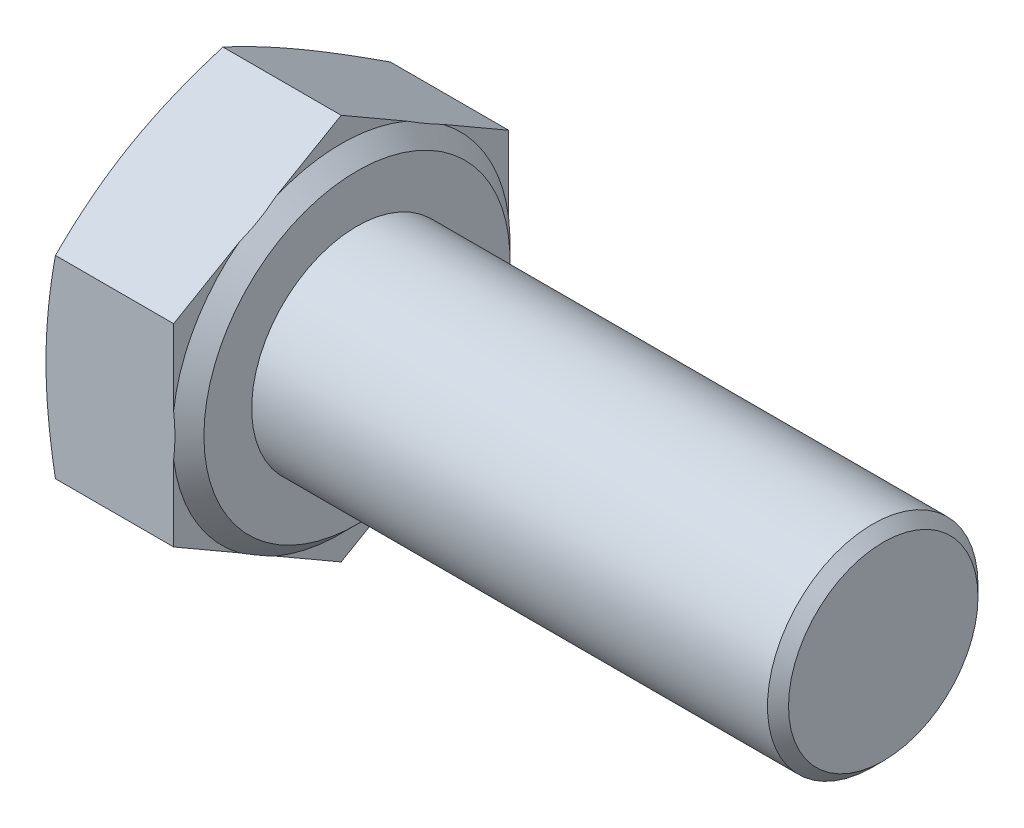
ISO-10303-21;
HEADER;
FILE_DESCRIPTION(('STEP AP214'),'2;1');
FILE_NAME('part.step','',(''),(''),'','','');
FILE_SCHEMA(('AUTOMOTIVE_DESIGN { 1 0 10303 214 1 1 1 1 }'));
ENDSEC;
DATA;
#1=APPLICATION_CONTEXT('core data for automotive mechanical design processes');
#2=APPLICATION_PROTOCOL_DEFINITION('international standard','automotive_design',2000,#1);
#3=PRODUCT_CONTEXT('',#1,'mechanical');
#4=PRODUCT('Part','Part','',(#3));
#5=PRODUCT_RELATED_PRODUCT_CATEGORY('part','',(#4));
#6=PRODUCT_DEFINITION_FORMATION('','',#4);
#7=PRODUCT_DEFINITION_CONTEXT('part definition',#1,'design');
#8=PRODUCT_DEFINITION('design','',#6,#7);
#9=PRODUCT_DEFINITION_SHAPE('','',#8);
#10=(LENGTH_UNIT() NAMED_UNIT(*) SI_UNIT(.MILLI.,.METRE.));
#11=(NAMED_UNIT(*) PLANE_ANGLE_UNIT() SI_UNIT($,.RADIAN.));
#12=(NAMED_UNIT(*) SI_UNIT($,.STERADIAN.) SOLID_ANGLE_UNIT());
#13=UNCERTAINTY_MEASURE_WITH_UNIT(LENGTH_MEASURE(1.E-05),#10,'distance_accuracy_value','');
#14=(GEOMETRIC_REPRESENTATION_CONTEXT(3) GLOBAL_UNCERTAINTY_ASSIGNED_CONTEXT((#13)) GLOBAL_UNIT_ASSIGNED_CONTEXT((#10,
#11,#12)) REPRESENTATION_CONTEXT('',''));
#15=CARTESIAN_POINT('',(0.,0.,0.));
#16=DIRECTION('',(0.,0.,1.));
#17=DIRECTION('',(1.,0.,0.));
#18=AXIS2_PLACEMENT_3D('',#15,#16,#17);
#19=CARTESIAN_POINT('',(5.45,-3.67483446339197,-6.365));
#20=DIRECTION('',(1.,0.,0.));
#21=DIRECTION('',(0.,0.,-1.));
#22=AXIS2_PLACEMENT_3D('',#19,#20,#21);
#23=PLANE('',#22);
#24=CARTESIAN_POINT('',(5.45,0.,0.));
#25=DIRECTION('',(-1.,0.,0.));
#26=DIRECTION('',(0.,0.,1.));
#27=AXIS2_PLACEMENT_3D('',#24,#25,#26);
#28=CIRCLE('',#27,5.815);
#29=CARTESIAN_POINT('',(5.45,0.,5.815));
#30=VERTEX_POINT('',#29);
#31=EDGE_CURVE('E360',#30,#30,#28,.T.);
#32=ORIENTED_EDGE('',*,*,#31,.F.);
#33=EDGE_LOOP('',(#32));
#34=FACE_BOUND('',#33,.T.);
#35=CARTESIAN_POINT('',(5.45,0.,0.));
#36=DIRECTION('',(1.,0.,0.));
#37=DIRECTION('',(0.,0.,-1.));
#38=AXIS2_PLACEMENT_3D('',#35,#36,#37);
#39=CIRCLE('',#38,4.);
#40=CARTESIAN_POINT('',(5.45,0.,-4.));
#41=VERTEX_POINT('',#40);
#42=EDGE_CURVE('E363',#41,#41,#39,.T.);
#43=ORIENTED_EDGE('',*,*,#42,.F.);
#44=EDGE_LOOP('',(#43));
#45=FACE_BOUND('',#44,.T.);
#46=ADVANCED_FACE('F36',(#34,#45),#23,.T.);
#47=CARTESIAN_POINT('',(5.45,-7.34966892678394,0.));
#48=DIRECTION('',(0.,0.866025403784439,0.5));
#49=DIRECTION('',(0.,-0.5,0.866025403784439));
#50=AXIS2_PLACEMENT_3D('',#47,#48,#49);
#51=PLANE('',#50);
#52=CARTESIAN_POINT('',(0.358432208609164,-3.67471899333814,-6.3652));
#53=CARTESIAN_POINT('',(0.303017853386463,-3.82691148046277,-6.10159487976986));
#54=CARTESIAN_POINT('',(0.252608898537304,-3.9796058343014,-5.83712050089245));
#55=CARTESIAN_POINT('',(0.163922131489335,-4.28598738129872,-5.30645209499154));
#56=CARTESIAN_POINT('',(0.125653812123521,-4.43967525596498,-5.0402568875623));
#57=CARTESIAN_POINT('',(0.0637558982239282,-4.74633825306905,-4.50910099577671));
#58=CARTESIAN_POINT('',(0.039991294188006,-4.8993063719615,-4.24415244191675));
#59=CARTESIAN_POINT('',(0.00811628005094118,-5.2056003294291,-3.71363574553151));
#60=CARTESIAN_POINT('',(0.,-5.35892601225853,-3.44806787276576));
#61=CARTESIAN_POINT('',(0.,-5.66557737791738,-2.91693212723424));
#62=CARTESIAN_POINT('',(0.00811628005094086,-5.81890306074681,-2.65136425446849));
#63=CARTESIAN_POINT('',(0.0399912941880058,-6.12519701821442,-2.12084755808325));
#64=CARTESIAN_POINT('',(0.0637558982239282,-6.27816513710686,-1.85589900422329));
#65=CARTESIAN_POINT('',(0.125653812123521,-6.58482813421093,-1.3247431124377));
#66=CARTESIAN_POINT('',(0.163922131489335,-6.73851600887719,-1.05854790500846));
#67=CARTESIAN_POINT('',(0.252608898537304,-7.04489755587451,-0.527879499107551));
#68=CARTESIAN_POINT('',(0.303017853386463,-7.19759190971314,-0.263405120230137));
#69=CARTESIAN_POINT('',(0.358432208609163,-7.34978439683778,0.000200000000000764));
#70=B_SPLINE_CURVE_WITH_KNOTS('',3,(#52,#53,#54,#55,#56,#57,#58,#59,#60,#61,#62,#63,#64,#65,#66,
#67,#68,#69),.UNSPECIFIED.,.F.,.F.,(4,2,2,2,2,2,2,2,4),(0.,0.928259882660235,1.85724379836754,
2.77744274027351,3.69729643285265,4.6171501254318,5.53734906733777,6.46633298304507,
7.39459286570531),.UNSPECIFIED.);
#71=CARTESIAN_POINT('',(0.358390179956193,-3.67483446339197,-6.365));
#72=VERTEX_POINT('',#71);
#73=CARTESIAN_POINT('',(0.,-5.51225169508795,-3.1825));
#74=VERTEX_POINT('',#73);
#75=EDGE_CURVE('E150',#72,#74,#70,.T.);
#76=ORIENTED_EDGE('',*,*,#75,.F.);
#77=DIRECTION('',(-1.,0.,0.));
#78=VECTOR('',#77,1.);
#79=CARTESIAN_POINT('',(5.45,-3.67483446339197,-6.365));
#80=LINE('',#79,#78);
#81=CARTESIAN_POINT('',(4.85,-3.67483446339197,-6.365));
#82=VERTEX_POINT('',#81);
#83=EDGE_CURVE('E179',#82,#72,#80,.T.);
#84=ORIENTED_EDGE('',*,*,#83,.F.);
#85=DIRECTION('',(0.,0.5,-0.866025403784439));
#86=VECTOR('',#85,1.);
#87=CARTESIAN_POINT('',(4.85,-7.34966892678394,0.));
#88=LINE('',#87,#86);
#89=CARTESIAN_POINT('',(4.85,-5.11256431725372,-3.87477884555287));
#90=VERTEX_POINT('',#89);
#91=EDGE_CURVE('E401',#90,#82,#88,.T.);
#92=ORIENTED_EDGE('',*,*,#91,.F.);
#93=CARTESIAN_POINT('',(4.8498,-5.91274078357852,-2.48883255085739));
#94=CARTESIAN_POINT('',(4.86645104578208,-5.84620990023086,-2.60406742108799));
#95=CARTESIAN_POINT('',(4.8790176064367,-5.77941769363161,-2.71975491646752));
#96=CARTESIAN_POINT('',(4.8957758431454,-5.64583354605375,-2.95112944715814));
#97=CARTESIAN_POINT('',(4.9,-5.57904262057086,-3.06681472357907));
#98=CARTESIAN_POINT('',(4.9,-5.44546076960506,-3.29818527642093));
#99=CARTESIAN_POINT('',(4.8957758431454,-5.37866984412216,-3.41387055284185));
#100=CARTESIAN_POINT('',(4.8790176064367,-5.2450856965443,-3.64524508353248));
#101=CARTESIAN_POINT('',(4.86645104578208,-5.17829348994506,-3.76093257891201));
#102=CARTESIAN_POINT('',(4.8498,-5.11176260659739,-3.87616744914261));
#103=B_SPLINE_CURVE_WITH_KNOTS('',3,(#93,#94,#95,#96,#97,#98,#99,#100,#101,#102),.UNSPECIFIED.,
.F.,.F.,(4,2,2,2,4),(0.,0.402253789710957,0.802938309087751,1.20362282846455,1.6058766181755),.UNSPECIFIED.);
#104=CARTESIAN_POINT('',(4.85,-5.91193907292219,-2.49022115444713));
#105=VERTEX_POINT('',#104);
#106=EDGE_CURVE('E292',#105,#90,#103,.T.);
#107=ORIENTED_EDGE('',*,*,#106,.F.);
#108=CARTESIAN_POINT('',(4.85,-7.34966892678394,0.));
#109=VERTEX_POINT('',#108);
#110=EDGE_CURVE('E406',#109,#105,#88,.T.);
#111=ORIENTED_EDGE('',*,*,#110,.F.);
#112=DIRECTION('',(-1.,0.,0.));
#113=VECTOR('',#112,1.);
#114=CARTESIAN_POINT('',(5.45,-7.34966892678394,0.));
#115=LINE('',#114,#113);
#116=CARTESIAN_POINT('',(0.358390179956193,-7.34966892678394,0.));
#117=VERTEX_POINT('',#116);
#118=EDGE_CURVE('E173',#109,#117,#115,.T.);
#119=ORIENTED_EDGE('',*,*,#118,.T.);
#120=EDGE_CURVE('E204',#74,#117,#70,.T.);
#121=ORIENTED_EDGE('',*,*,#120,.F.);
#122=EDGE_LOOP('',(#76,#84,#92,#107,#111,#119,#121));
#123=FACE_BOUND('',#122,.T.);
#124=ADVANCED_FACE('F219',(#123),#51,.F.);
#125=CARTESIAN_POINT('',(5.45,-3.67483446339197,-6.365));
#126=DIRECTION('',(0.,0.,1.));
#127=DIRECTION('',(0.,-1.,0.));
#128=AXIS2_PLACEMENT_3D('',#125,#126,#127);
#129=PLANE('',#128);
#130=CARTESIAN_POINT('',(1.91509533591241,-9.72967062799653,-6.365));
#131=CARTESIAN_POINT('',(1.82740685310746,-9.44169496681688,-6.365));
#132=CARTESIAN_POINT('',(1.74074158058572,-9.15340194592941,-6.365));
#133=CARTESIAN_POINT('',(1.57002349461601,-8.57601961509125,-6.365));
#134=CARTESIAN_POINT('',(1.48597088789315,-8.28693024409016,-6.365));
#135=CARTESIAN_POINT('',(1.32090435125301,-7.70729883573411,-6.365));
#136=CARTESIAN_POINT('',(1.23989638334084,-7.41675509439315,-6.365));
#137=CARTESIAN_POINT('',(1.08186750694324,-6.83458682179728,-6.365));
#138=CARTESIAN_POINT('',(1.0048465268705,-6.54296231004868,-6.365));
#139=CARTESIAN_POINT('',(0.856698011009507,-5.96204179886127,-6.365));
#140=CARTESIAN_POINT('',(0.785509520514274,-5.67276142172824,-6.365));
#141=CARTESIAN_POINT('',(0.649193386005211,-5.09276117088984,-6.365));
#142=CARTESIAN_POINT('',(0.584065843988247,-4.80204127304614,-6.365));
#143=CARTESIAN_POINT('',(0.461389994540051,-4.21909692928576,-6.365));
#144=CARTESIAN_POINT('',(0.403839101725581,-3.92687303213234,-6.365));
#145=CARTESIAN_POINT('',(0.298068957571554,-3.34072867531993,-6.365));
#146=CARTESIAN_POINT('',(0.249849393577955,-3.04680827284372,-6.365));
#147=CARTESIAN_POINT('',(0.169475269694195,-2.49036754805804,-6.365));
#148=CARTESIAN_POINT('',(0.136125668658571,-2.22802146437677,-6.365));
#149=CARTESIAN_POINT('',(0.0796727381155363,-1.70221996764775,-6.365));
#150=CARTESIAN_POINT('',(0.0565691100298883,-1.43876458715194,-6.365));
#151=CARTESIAN_POINT('',(0.0217207487441093,-0.911278881401206,-6.365));
#152=CARTESIAN_POINT('',(0.00996798122784632,-0.647249095585921,-6.365));
#153=CARTESIAN_POINT('',(-0.00158361869585211,-0.118925367790681,-6.365));
#154=CARTESIAN_POINT('',(-0.00138253552102513,0.145368572310644,-6.365));
#155=CARTESIAN_POINT('',(0.0109939459696763,0.67501237638883,-6.365));
#156=CARTESIAN_POINT('',(0.0232300668970162,0.940360797807833,-6.365));
#157=CARTESIAN_POINT('',(0.0591135147245866,1.47027824625194,-6.365));
#158=CARTESIAN_POINT('',(0.0827611157780159,1.73484725439851,-6.365));
#159=CARTESIAN_POINT('',(0.14036130005099,2.26307523643802,-6.365));
#160=CARTESIAN_POINT('',(0.174322734401913,2.52673323118344,-6.365));
#161=CARTESIAN_POINT('',(0.251173018988131,3.05273020304769,-6.365));
#162=CARTESIAN_POINT('',(0.294061917071762,3.31506917308926,-6.365));
#163=CARTESIAN_POINT('',(0.38983930060547,3.85223310239566,-6.365));
#164=CARTESIAN_POINT('',(0.443136722334723,4.12698449767404,-6.365));
#165=CARTESIAN_POINT('',(0.556591286147286,4.67507636809315,-6.365));
#166=CARTESIAN_POINT('',(0.616748945391972,4.94841673523731,-6.365));
#167=CARTESIAN_POINT('',(0.742660698049467,5.49388136539486,-6.365));
#168=CARTESIAN_POINT('',(0.808416416790572,5.7660052509152,-6.365));
#169=CARTESIAN_POINT('',(0.94445499791568,6.30910658112765,-6.365));
#170=CARTESIAN_POINT('',(1.01473775178791,6.58008405313319,-6.365));
#171=CARTESIAN_POINT('',(1.15907513489816,7.12140033413079,-6.365));
#172=CARTESIAN_POINT('',(1.23313447339427,7.39173788299646,-6.365));
#173=CARTESIAN_POINT('',(1.38427063377748,7.93156975409726,-6.365));
#174=CARTESIAN_POINT('',(1.46134750009956,8.201064063852,-6.365));
#175=CARTESIAN_POINT('',(1.69623888685743,9.00837522016196,-6.365));
#176=CARTESIAN_POINT('',(1.85774082741465,9.54511848220269,-6.365));
#177=CARTESIAN_POINT('',(2.18566531874294,10.6106004903992,-6.365));
#178=CARTESIAN_POINT('',(2.35201388027534,11.1393621956268,-6.365));
#179=CARTESIAN_POINT('',(2.68943698081584,12.1954003383252,-6.365));
#180=CARTESIAN_POINT('',(2.86051174657033,12.7226767031926,-6.365));
#181=CARTESIAN_POINT('',(3.20545948603472,13.7740950439574,-6.365));
#182=CARTESIAN_POINT('',(3.3793193794315,14.298241321587,-6.365));
#183=CARTESIAN_POINT('',(3.64203864055547,15.0837906039833,-6.365));
#184=CARTESIAN_POINT('',(3.72992971843083,15.3455181461989,-6.365));
#185=CARTESIAN_POINT('',(3.90628058973421,15.8687808819846,-6.365));
#186=CARTESIAN_POINT('',(3.99474038177596,16.1303160760218,-6.365));
#187=CARTESIAN_POINT('',(4.08344640915735,16.3917677152,-6.365));
#188=B_SPLINE_CURVE_WITH_KNOTS('',3,(#130,#131,#132,#133,#134,#135,#136,#137,#138,#139,#140,
#141,#142,#143,#144,#145,#146,#147,#148,#149,#150,#151,#152,#153,#154,#155,#156,#157,#158,#159,
#160,#161,#162,#163,#164,#165,#166,#167,#168,#169,#170,#171,#172,#173,#174,#175,#176,#177,#178,
#179,#180,#181,#182,#183,#184,#185,#186,#187),.UNSPECIFIED.,.F.,.F.,(4,2,2,2,2,2,2,2,2,2,2,2,2,
2,2,2,2,2,2,2,2,2,2,2,2,2,2,2,4),(0.,0.903097347428739,1.80626597076171,2.71111968224921,
3.61595714123714,4.50963841789911,5.4033347311866,6.29672529327806,7.19008591638045,
7.98328363828434,8.77645824406809,9.56907101614613,10.3616781908171,11.1583050756945,
11.9549510999544,12.7522827315906,13.5496186367781,14.3891305208626,15.2287057337291,
16.0685255438014,16.9083252311134,17.7491990224401,18.5900852008205,20.271552402444,
21.9344598545306,23.5974472260011,25.2541246601636,26.0823966500058,26.9106666216669),.UNSPECIFIED.);
#189=CARTESIAN_POINT('',(0.358390179956193,3.67483446339197,-6.365));
#190=VERTEX_POINT('',#189);
#191=CARTESIAN_POINT('',(0.,0.,-6.365));
#192=VERTEX_POINT('',#191);
#193=EDGE_CURVE('E269',#190,#192,#188,.F.);
#194=ORIENTED_EDGE('',*,*,#193,.F.);
#195=DIRECTION('',(-1.,0.,0.));
#196=VECTOR('',#195,1.);
#197=CARTESIAN_POINT('',(5.45,3.67483446339197,-6.365));
#198=LINE('',#197,#196);
#199=CARTESIAN_POINT('',(4.85,3.67483446339197,-6.365));
#200=VERTEX_POINT('',#199);
#201=EDGE_CURVE('E170',#200,#190,#198,.T.);
#202=ORIENTED_EDGE('',*,*,#201,.F.);
#203=DIRECTION('',(0.,1.,0.));
#204=VECTOR('',#203,1.);
#205=CARTESIAN_POINT('',(4.85,-3.67483446339197,-6.365));
#206=LINE('',#205,#204);
#207=CARTESIAN_POINT('',(4.85,0.799374755668501,-6.365));
#208=VERTEX_POINT('',#207);
#209=EDGE_CURVE('E407',#208,#200,#206,.T.);
#210=ORIENTED_EDGE('',*,*,#209,.F.);
#211=CARTESIAN_POINT('',(4.03279951704433,-3.43387519075233,-6.365));
#212=CARTESIAN_POINT('',(4.12915263849273,-3.23085023011694,-6.365));
#213=CARTESIAN_POINT('',(4.22025748585871,-3.02511909944975,-6.365));
#214=CARTESIAN_POINT('',(4.38924442875649,-2.607586142848,-6.365));
#215=CARTESIAN_POINT('',(4.46708471573415,-2.39576749483417,-6.365));
#216=CARTESIAN_POINT('',(4.60570873768971,-1.96811964987368,-6.365));
#217=CARTESIAN_POINT('',(4.66660505783177,-1.75232760532108,-6.365));
#218=CARTESIAN_POINT('',(4.76875528549822,-1.31633465245686,-6.365));
#219=CARTESIAN_POINT('',(4.81003455600801,-1.09613982269909,-6.365));
#220=CARTESIAN_POINT('',(4.86166598674748,-0.716857278788027,-6.365));
#221=CARTESIAN_POINT('',(4.87750915855413,-0.558507647439388,-6.365));
#222=CARTESIAN_POINT('',(4.89740688876809,-0.241033868209288,-6.365));
#223=CARTESIAN_POINT('',(4.90146005034603,-0.0819096307926899,-6.365));
#224=CARTESIAN_POINT('',(4.89760366254159,0.236307876778583,-6.365));
#225=CARTESIAN_POINT('',(4.8896854485106,0.395401041070628,-6.365));
#226=CARTESIAN_POINT('',(4.86219166047059,0.712536056449976,-6.365));
#227=CARTESIAN_POINT('',(4.84261749559239,0.870578032284362,-6.365));
#228=CARTESIAN_POINT('',(4.77989629912372,1.26397857327129,-6.365));
#229=CARTESIAN_POINT('',(4.72984501952514,1.49825109784234,-6.365));
#230=CARTESIAN_POINT('',(4.60840439500463,1.96142866466619,-6.365));
#231=CARTESIAN_POINT('',(4.53698240024109,2.19032491185727,-6.365));
#232=CARTESIAN_POINT('',(4.37639278374581,2.64284924670944,-6.365));
#233=CARTESIAN_POINT('',(4.28714977555017,2.86645027951899,-6.365));
#234=CARTESIAN_POINT('',(4.14298757672639,3.1968115005545,-6.365));
#235=CARTESIAN_POINT('',(4.09331043783534,3.30591051664446,-6.365));
#236=CARTESIAN_POINT('',(3.99087238919469,3.52261302856447,-6.365));
#237=CARTESIAN_POINT('',(3.93811240732307,3.63021696243971,-6.365));
#238=CARTESIAN_POINT('',(3.88398571887171,3.73713082701421,-6.365));
#239=B_SPLINE_CURVE_WITH_KNOTS('',3,(#211,#212,#213,#214,#215,#216,#217,#218,#219,#220,#221,
#222,#223,#224,#225,#226,#227,#228,#229,#230,#231,#232,#233,#234,#235,#236,#237,#238),
.UNSPECIFIED.,.F.,.F.,(4,2,2,2,2,2,2,2,2,2,2,2,2,4),(0.,0.674405155060001,1.35089815376226,
2.02278254460677,2.69379587324144,3.17081389671399,3.64788843291527,4.1253084317203,
4.60267072517737,5.32008921030019,6.03860940161102,6.76023604416636,7.11982798490662,
7.47931224719879),.UNSPECIFIED.);
#240=CARTESIAN_POINT('',(4.85,-0.799374755668498,-6.365));
#241=VERTEX_POINT('',#240);
#242=EDGE_CURVE('E285',#241,#208,#239,.T.);
#243=ORIENTED_EDGE('',*,*,#242,.F.);
#244=EDGE_CURVE('E403',#82,#241,#206,.T.);
#245=ORIENTED_EDGE('',*,*,#244,.F.);
#246=ORIENTED_EDGE('',*,*,#83,.T.);
#247=EDGE_CURVE('E161',#192,#72,#188,.F.);
#248=ORIENTED_EDGE('',*,*,#247,.F.);
#249=EDGE_LOOP('',(#194,#202,#210,#243,#245,#246,#248));
#250=FACE_BOUND('',#249,.T.);
#251=ADVANCED_FACE('F277',(#250),#129,.F.);
#252=CARTESIAN_POINT('',(5.45,3.67483446339197,-6.365));
#253=DIRECTION('',(0.,-0.866025403784439,0.5));
#254=DIRECTION('',(0.,-0.5,-0.866025403784439));
#255=AXIS2_PLACEMENT_3D('',#252,#253,#254);
#256=PLANE('',#255);
#257=CARTESIAN_POINT('',(0.358432208609163,7.34978439683778,0.000199999999999699));
#258=CARTESIAN_POINT('',(0.303017853386462,7.19759190971314,-0.263405120230139));
#259=CARTESIAN_POINT('',(0.252608898537303,7.04489755587451,-0.527879499107552));
#260=CARTESIAN_POINT('',(0.163922131489334,6.73851600887719,-1.05854790500846));
#261=CARTESIAN_POINT('',(0.125653812123521,6.58482813421093,-1.3247431124377));
#262=CARTESIAN_POINT('',(0.0637558982239276,6.27816513710686,-1.85589900422329));
#263=CARTESIAN_POINT('',(0.039991294188005,6.12519701821441,-2.12084755808325));
#264=CARTESIAN_POINT('',(0.00811628005093996,5.81890306074681,-2.65136425446849));
#265=CARTESIAN_POINT('',(0.,5.66557737791738,-2.91693212723424));
#266=CARTESIAN_POINT('',(0.,5.35892601225853,-3.44806787276576));
#267=CARTESIAN_POINT('',(0.00811628005093988,5.2056003294291,-3.71363574553151));
#268=CARTESIAN_POINT('',(0.0399912941880047,4.89930637196149,-4.24415244191675));
#269=CARTESIAN_POINT('',(0.0637558982239272,4.74633825306905,-4.50910099577671));
#270=CARTESIAN_POINT('',(0.12565381212352,4.43967525596498,-5.0402568875623));
#271=CARTESIAN_POINT('',(0.163922131489334,4.28598738129872,-5.30645209499153));
#272=CARTESIAN_POINT('',(0.252608898537303,3.9796058343014,-5.83712050089245));
#273=CARTESIAN_POINT('',(0.303017853386462,3.82691148046276,-6.10159487976986));
#274=CARTESIAN_POINT('',(0.358432208609162,3.67471899333813,-6.3652));
#275=B_SPLINE_CURVE_WITH_KNOTS('',3,(#257,#258,#259,#260,#261,#262,#263,#264,#265,#266,#267,
#268,#269,#270,#271,#272,#273,#274),.UNSPECIFIED.,.F.,.F.,(4,2,2,2,2,2,2,2,4),(0.,
0.928259882660236,1.85724379836754,2.77744274027351,3.69729643285265,4.6171501254318,
5.53734906733777,6.46633298304507,7.39459286570531),.UNSPECIFIED.);
#276=CARTESIAN_POINT('',(0.358390179956193,7.34966892678394,0.));
#277=VERTEX_POINT('',#276);
#278=CARTESIAN_POINT('',(0.,5.51225169508795,-3.1825));
#279=VERTEX_POINT('',#278);
#280=EDGE_CURVE('E51',#277,#279,#275,.T.);
#281=ORIENTED_EDGE('',*,*,#280,.F.);
#282=DIRECTION('',(-1.,0.,0.));
#283=VECTOR('',#282,1.);
#284=CARTESIAN_POINT('',(5.45,7.34966892678394,0.));
#285=LINE('',#284,#283);
#286=CARTESIAN_POINT('',(4.85,7.34966892678394,0.));
#287=VERTEX_POINT('',#286);
#288=EDGE_CURVE('E167',#287,#277,#285,.T.);
#289=ORIENTED_EDGE('',*,*,#288,.F.);
#290=DIRECTION('',(0.,0.5,0.866025403784439));
#291=VECTOR('',#290,1.);
#292=CARTESIAN_POINT('',(4.85,3.67483446339197,-6.365));
#293=LINE('',#292,#291);
#294=CARTESIAN_POINT('',(4.85,5.9119390729222,-2.49022115444711));
#295=VERTEX_POINT('',#294);
#296=EDGE_CURVE('E431',#295,#287,#293,.T.);
#297=ORIENTED_EDGE('',*,*,#296,.F.);
#298=CARTESIAN_POINT('',(4.8498,5.11176260659737,-3.87616744914263));
#299=CARTESIAN_POINT('',(4.86645104578208,5.17829348994504,-3.76093257891203));
#300=CARTESIAN_POINT('',(4.8790176064367,5.24508569654429,-3.64524508353249));
#301=CARTESIAN_POINT('',(4.8957758431454,5.37866984412215,-3.41387055284186));
#302=CARTESIAN_POINT('',(4.9,5.44546076960505,-3.29818527642093));
#303=CARTESIAN_POINT('',(4.9,5.57904262057086,-3.06681472357907));
#304=CARTESIAN_POINT('',(4.8957758431454,5.64583354605376,-2.95112944715813));
#305=CARTESIAN_POINT('',(4.8790176064367,5.77941769363162,-2.7197549164675));
#306=CARTESIAN_POINT('',(4.86645104578208,5.84620990023087,-2.60406742108796));
#307=CARTESIAN_POINT('',(4.8498,5.91274078357854,-2.48883255085736));
#308=B_SPLINE_CURVE_WITH_KNOTS('',3,(#298,#299,#300,#301,#302,#303,#304,#305,#306,#307),
.UNSPECIFIED.,.F.,.F.,(4,2,2,2,4),(0.,0.402253789710971,0.80293830908778,1.20362282846459,
1.60587661817556),.UNSPECIFIED.);
#309=CARTESIAN_POINT('',(4.85,5.11256431725371,-3.87477884555289));
#310=VERTEX_POINT('',#309);
#311=EDGE_CURVE('E293',#310,#295,#308,.T.);
#312=ORIENTED_EDGE('',*,*,#311,.F.);
#313=EDGE_CURVE('E426',#200,#310,#293,.T.);
#314=ORIENTED_EDGE('',*,*,#313,.F.);
#315=ORIENTED_EDGE('',*,*,#201,.T.);
#316=EDGE_CURVE('E270',#279,#190,#275,.T.);
#317=ORIENTED_EDGE('',*,*,#316,.F.);
#318=EDGE_LOOP('',(#281,#289,#297,#312,#314,#315,#317));
#319=FACE_BOUND('',#318,.T.);
#320=ADVANCED_FACE('F280',(#319),#256,.F.);
#321=CARTESIAN_POINT('',(5.45,7.34966892678394,0.));
#322=DIRECTION('',(0.,-0.866025403784439,-0.5));
#323=DIRECTION('',(0.,0.5,-0.866025403784439));
#324=AXIS2_PLACEMENT_3D('',#321,#322,#323);
#325=PLANE('',#324);
#326=CARTESIAN_POINT('',(0.358432208609163,3.67471899333813,6.3652));
#327=CARTESIAN_POINT('',(0.303017853386462,3.82691148046277,6.10159487976986));
#328=CARTESIAN_POINT('',(0.252608898537303,3.9796058343014,5.83712050089245));
#329=CARTESIAN_POINT('',(0.163922131489335,4.28598738129872,5.30645209499154));
#330=CARTESIAN_POINT('',(0.125653812123521,4.43967525596498,5.0402568875623));
#331=CARTESIAN_POINT('',(0.0637558982239277,4.74633825306905,4.50910099577671));
#332=CARTESIAN_POINT('',(0.0399912941880049,4.89930637196149,4.24415244191675));
#333=CARTESIAN_POINT('',(0.00811628005094001,5.2056003294291,3.71363574553151));
#334=CARTESIAN_POINT('',(0.,5.35892601225853,3.44806787276576));
#335=CARTESIAN_POINT('',(0.,5.66557737791738,2.91693212723424));
#336=CARTESIAN_POINT('',(0.00811628005094,5.81890306074681,2.65136425446849));
#337=CARTESIAN_POINT('',(0.0399912941880049,6.12519701821441,2.12084755808325));
#338=CARTESIAN_POINT('',(0.0637558982239277,6.27816513710686,1.85589900422329));
#339=CARTESIAN_POINT('',(0.125653812123521,6.58482813421093,1.3247431124377));
#340=CARTESIAN_POINT('',(0.163922131489335,6.73851600887719,1.05854790500846));
#341=CARTESIAN_POINT('',(0.252608898537303,7.04489755587451,0.52787949910755));
#342=CARTESIAN_POINT('',(0.303017853386462,7.19759190971314,0.263405120230137));
#343=CARTESIAN_POINT('',(0.358432208609163,7.34978439683777,-0.000200000000001009));
#344=B_SPLINE_CURVE_WITH_KNOTS('',3,(#326,#327,#328,#329,#330,#331,#332,#333,#334,#335,#336,
#337,#338,#339,#340,#341,#342,#343),.UNSPECIFIED.,.F.,.F.,(4,2,2,2,2,2,2,2,4),(0.,
0.928259882660236,1.85724379836754,2.77744274027351,3.69729643285266,4.6171501254318,
5.53734906733777,6.46633298304508,7.39459286570531),.UNSPECIFIED.);
#345=CARTESIAN_POINT('',(0.358390179956193,3.67483446339197,6.365));
#346=VERTEX_POINT('',#345);
#347=CARTESIAN_POINT('',(0.,5.51225169508795,3.1825));
#348=VERTEX_POINT('',#347);
#349=EDGE_CURVE('E59',#346,#348,#344,.T.);
#350=ORIENTED_EDGE('',*,*,#349,.F.);
#351=DIRECTION('',(-1.,0.,0.));
#352=VECTOR('',#351,1.);
#353=CARTESIAN_POINT('',(5.45,3.67483446339197,6.365));
#354=LINE('',#353,#352);
#355=CARTESIAN_POINT('',(4.85,3.67483446339197,6.365));
#356=VERTEX_POINT('',#355);
#357=EDGE_CURVE('E158',#356,#346,#354,.T.);
#358=ORIENTED_EDGE('',*,*,#357,.F.);
#359=DIRECTION('',(0.,-0.5,0.866025403784439));
#360=VECTOR('',#359,1.);
#361=CARTESIAN_POINT('',(4.85,7.34966892678394,0.));
#362=LINE('',#361,#360);
#363=CARTESIAN_POINT('',(4.85,5.11256431725372,3.87477884555288));
#364=VERTEX_POINT('',#363);
#365=EDGE_CURVE('E438',#364,#356,#362,.T.);
#366=ORIENTED_EDGE('',*,*,#365,.F.);
#367=CARTESIAN_POINT('',(4.8498,5.91274078357853,2.48883255085737));
#368=CARTESIAN_POINT('',(4.86645104578209,5.84620990023082,2.60406742108805));
#369=CARTESIAN_POINT('',(4.87901760643672,5.77941769363152,2.71975491646767));
#370=CARTESIAN_POINT('',(4.89577584314542,5.64583354605357,2.95112944715846));
#371=CARTESIAN_POINT('',(4.90000000000002,5.57904262057062,3.06681472357947));
#372=CARTESIAN_POINT('',(4.89999999999999,5.44546076960473,3.2981852764215));
#373=CARTESIAN_POINT('',(4.89577584314537,5.37866984412178,3.41387055284251));
#374=CARTESIAN_POINT('',(4.87901760643663,5.24508569654383,3.6452450835333));
#375=CARTESIAN_POINT('',(4.86645104578197,5.17829348994454,3.76093257891291));
#376=CARTESIAN_POINT('',(4.84979999999986,5.11176260659682,3.87616744914359));
#377=B_SPLINE_CURVE_WITH_KNOTS('',3,(#367,#368,#369,#370,#371,#372,#373,#374,#375,#376),
.UNSPECIFIED.,.F.,.F.,(4,2,2,2,4),(0.,0.402253789711247,0.80293830908833,1.20362282846541,
1.60587661817666),.UNSPECIFIED.);
#378=CARTESIAN_POINT('',(4.85,5.91193907292219,2.49022115444712));
#379=VERTEX_POINT('',#378);
#380=EDGE_CURVE('E329',#379,#364,#377,.T.);
#381=ORIENTED_EDGE('',*,*,#380,.F.);
#382=EDGE_CURVE('E437',#287,#379,#362,.T.);
#383=ORIENTED_EDGE('',*,*,#382,.F.);
#384=ORIENTED_EDGE('',*,*,#288,.T.);
#385=EDGE_CURVE('E160',#348,#277,#344,.T.);
#386=ORIENTED_EDGE('',*,*,#385,.F.);
#387=EDGE_LOOP('',(#350,#358,#366,#381,#383,#384,#386));
#388=FACE_BOUND('',#387,.T.);
#389=ADVANCED_FACE('F156',(#388),#325,.F.);
#390=CARTESIAN_POINT('',(5.45,3.67483446339197,6.365));
#391=DIRECTION('',(0.,0.,-1.));
#392=DIRECTION('',(-1.,0.,0.));
#393=AXIS2_PLACEMENT_3D('',#390,#391,#392);
#394=PLANE('',#393);
#395=CARTESIAN_POINT('',(1.91509499186738,-9.72966949844239,6.365));
#396=CARTESIAN_POINT('',(1.8274065254308,-9.44169388100942,6.365));
#397=CARTESIAN_POINT('',(1.74074126923368,-9.15340090389344,6.365));
#398=CARTESIAN_POINT('',(1.57002321571732,-8.57601866069177,6.365));
#399=CARTESIAN_POINT('',(1.48597062512316,-8.28692933355568,6.365));
#400=CARTESIAN_POINT('',(1.32090412051867,-7.70729801333673,6.365));
#401=CARTESIAN_POINT('',(1.23989616851068,-7.41675431626872,6.365));
#402=CARTESIAN_POINT('',(1.08186732342096,-6.83458613240286,6.365));
#403=CARTESIAN_POINT('',(1.00484635875195,-6.54296166511131,6.365));
#404=CARTESIAN_POINT('',(0.856697872735635,-5.96204124254701,6.365));
#405=CARTESIAN_POINT('',(0.785509396690931,-5.67276090957681,6.365));
#406=CARTESIAN_POINT('',(0.649193289931609,-5.09276074741788,6.365));
#407=CARTESIAN_POINT('',(0.584065761213717,-4.80204089409085,6.365));
#408=CARTESIAN_POINT('',(0.461389936625071,-4.21909663970474,6.365));
#409=CARTESIAN_POINT('',(0.403839055373966,-3.92687278740827,6.365));
#410=CARTESIAN_POINT('',(0.298068931881599,-3.34072852082149,6.365));
#411=CARTESIAN_POINT('',(0.249849376986923,-3.04680816371384,6.365));
#412=CARTESIAN_POINT('',(0.169475259692935,-2.49036747373219,6.365));
#413=CARTESIAN_POINT('',(0.136125658249983,-2.2280213791775,6.365));
#414=CARTESIAN_POINT('',(0.0796727278870326,-1.70221986064311,6.365));
#415=CARTESIAN_POINT('',(0.0565691003887715,-1.43876446921536,6.365));
#416=CARTESIAN_POINT('',(0.0217207413568146,-0.911278741623907,6.365));
#417=CARTESIAN_POINT('',(0.00996797550584915,-0.647248944899864,6.365));
#418=CARTESIAN_POINT('',(-0.00158362003896287,-0.118925195375249,6.365));
#419=CARTESIAN_POINT('',(-0.00138253415055002,0.145368755546692,6.365));
#420=CARTESIAN_POINT('',(0.0109939536907349,0.675012581557856,6.365));
#421=CARTESIAN_POINT('',(0.0232300782774906,0.940361014088006,6.365));
#422=CARTESIAN_POINT('',(0.059113534129279,1.47027848456429,6.365));
#423=CARTESIAN_POINT('',(0.0827611395476115,1.73484750363189,6.365));
#424=CARTESIAN_POINT('',(0.140361333008318,2.26307550737216,6.365));
#425=CARTESIAN_POINT('',(0.174322772183801,2.526733512897,6.365));
#426=CARTESIAN_POINT('',(0.251173066655277,3.05273050616951,6.365));
#427=CARTESIAN_POINT('',(0.294061969799615,3.31506948683989,6.365));
#428=CARTESIAN_POINT('',(0.389839361833371,3.85223342679727,6.365));
#429=CARTESIAN_POINT('',(0.443136786671215,4.1269848221522,6.365));
#430=CARTESIAN_POINT('',(0.5565913561839,4.67507669275939,6.365));
#431=CARTESIAN_POINT('',(0.616749018019995,4.94841706001511,6.365));
#432=CARTESIAN_POINT('',(0.742660775422186,5.49388169043513,6.365));
#433=CARTESIAN_POINT('',(0.808416496316158,5.76600557610648,6.365));
#434=CARTESIAN_POINT('',(0.944455081390745,6.3091069066798,6.365));
#435=CARTESIAN_POINT('',(1.01473783705962,6.58008437889519,6.365));
#436=CARTESIAN_POINT('',(1.1590752234491,7.12140066025616,6.365));
#437=CARTESIAN_POINT('',(1.23313456342593,7.39173820927583,6.365));
#438=CARTESIAN_POINT('',(1.38427072653872,7.93157008073458,6.365));
#439=CARTESIAN_POINT('',(1.46134759410965,8.20106439069328,6.365));
#440=CARTESIAN_POINT('',(1.6962389843436,9.00837554769518,6.365));
#441=CARTESIAN_POINT('',(1.85774092685404,9.54511881028883,6.365));
#442=CARTESIAN_POINT('',(2.18566542053363,10.6106008162262,6.365));
#443=CARTESIAN_POINT('',(2.35201398242584,11.1393625186539,6.365));
#444=CARTESIAN_POINT('',(2.6894370833329,12.1954006558518,6.365));
#445=CARTESIAN_POINT('',(2.86051184909409,12.7226770180188,6.365));
#446=CARTESIAN_POINT('',(3.2054595884782,13.7740953538946,6.365));
#447=CARTESIAN_POINT('',(3.37931948179169,14.2982416293346,6.365));
#448=CARTESIAN_POINT('',(3.64203874267391,15.0837909084871,6.365));
#449=CARTESIAN_POINT('',(3.72992982044976,15.3455184496299,6.365));
#450=CARTESIAN_POINT('',(3.90628069152081,15.8687811832806,6.365));
#451=CARTESIAN_POINT('',(3.99474048342973,16.1303163762558,6.365));
#452=CARTESIAN_POINT('',(4.08344651066458,16.3917680143764,6.365));
#453=B_SPLINE_CURVE_WITH_KNOTS('',3,(#395,#396,#397,#398,#399,#400,#401,#402,#403,#404,#405,
#406,#407,#408,#409,#410,#411,#412,#413,#414,#415,#416,#417,#418,#419,#420,#421,#422,#423,#424,
#425,#426,#427,#428,#429,#430,#431,#432,#433,#434,#435,#436,#437,#438,#439,#440,#441,#442,#443,
#444,#445,#446,#447,#448,#449,#450,#451,#452),.UNSPECIFIED.,.F.,.F.,(4,2,2,2,2,2,2,2,2,2,2,2,2,
2,2,2,2,2,2,2,2,2,2,2,2,2,2,2,4),(0.,0.903097207575023,1.80626569103696,2.71111926177277,
3.61595658001542,4.50963771767758,5.40333389194527,6.29672431533665,7.19008479979587,
7.98328255418381,8.77645719245087,9.56906999696307,10.3616772040682,11.1583041227231,
11.9549501807672,12.7522818463206,13.5496177854262,14.3891296715289,15.2287048864037,
16.0685246984409,16.9083243877203,17.7491981806695,18.5900843606705,20.2715515655816,
21.9344590099833,23.5974463737565,25.2541238016063,26.0823957883024,26.9106657568178),.UNSPECIFIED.);
#454=CARTESIAN_POINT('',(0.358390179956193,-3.67483446339197,6.365));
#455=VERTEX_POINT('',#454);
#456=CARTESIAN_POINT('',(0.,0.,6.365));
#457=VERTEX_POINT('',#456);
#458=EDGE_CURVE('E152',#455,#457,#453,.T.);
#459=ORIENTED_EDGE('',*,*,#458,.F.);
#460=DIRECTION('',(-1.,0.,0.));
#461=VECTOR('',#460,1.);
#462=CARTESIAN_POINT('',(5.45,-3.67483446339197,6.365));
#463=LINE('',#462,#461);
#464=CARTESIAN_POINT('',(4.85,-3.67483446339197,6.365));
#465=VERTEX_POINT('',#464);
#466=EDGE_CURVE('E168',#465,#455,#463,.T.);
#467=ORIENTED_EDGE('',*,*,#466,.F.);
#468=DIRECTION('',(0.,-1.,0.));
#469=VECTOR('',#468,1.);
#470=CARTESIAN_POINT('',(4.85,3.67483446339197,6.365));
#471=LINE('',#470,#469);
#472=CARTESIAN_POINT('',(4.85,-0.799374755668491,6.365));
#473=VERTEX_POINT('',#472);
#474=EDGE_CURVE('E377',#473,#465,#471,.T.);
#475=ORIENTED_EDGE('',*,*,#474,.F.);
#476=CARTESIAN_POINT('',(4.03279951704433,-3.43387519075233,6.365));
#477=CARTESIAN_POINT('',(4.12915263849273,-3.23085023011693,6.365));
#478=CARTESIAN_POINT('',(4.22025748585871,-3.02511909944974,6.365));
#479=CARTESIAN_POINT('',(4.38924442875649,-2.607586142848,6.365));
#480=CARTESIAN_POINT('',(4.46708471573415,-2.39576749483417,6.365));
#481=CARTESIAN_POINT('',(4.60570873768971,-1.96811964987368,6.365));
#482=CARTESIAN_POINT('',(4.66660505783177,-1.75232760532108,6.365));
#483=CARTESIAN_POINT('',(4.76875528549821,-1.31633465245685,6.365));
#484=CARTESIAN_POINT('',(4.81003455600801,-1.09613982269909,6.365));
#485=CARTESIAN_POINT('',(4.86166598674748,-0.716857278788024,6.365));
#486=CARTESIAN_POINT('',(4.87750915855413,-0.558507647439385,6.365));
#487=CARTESIAN_POINT('',(4.89740688876809,-0.241033868209286,6.365));
#488=CARTESIAN_POINT('',(4.90146005034603,-0.0819096307926873,6.365));
#489=CARTESIAN_POINT('',(4.89760366254159,0.236307876778586,6.365));
#490=CARTESIAN_POINT('',(4.8896854485106,0.395401041070631,6.365));
#491=CARTESIAN_POINT('',(4.86219166047059,0.712536056449979,6.365));
#492=CARTESIAN_POINT('',(4.84261749559239,0.870578032284365,6.365));
#493=CARTESIAN_POINT('',(4.77989629912372,1.26397857327129,6.365));
#494=CARTESIAN_POINT('',(4.72984501952513,1.49825109784234,6.365));
#495=CARTESIAN_POINT('',(4.60840439500463,1.9614286646662,6.365));
#496=CARTESIAN_POINT('',(4.53698240024109,2.19032491185728,6.365));
#497=CARTESIAN_POINT('',(4.37639278374581,2.64284924670944,6.365));
#498=CARTESIAN_POINT('',(4.28714977555017,2.866450279519,6.365));
#499=CARTESIAN_POINT('',(4.14298757672639,3.1968115005545,6.365));
#500=CARTESIAN_POINT('',(4.09331043783534,3.30591051664447,6.365));
#501=CARTESIAN_POINT('',(3.99087238919469,3.52261302856448,6.365));
#502=CARTESIAN_POINT('',(3.93811240732306,3.63021696243972,6.365));
#503=CARTESIAN_POINT('',(3.88398571887171,3.73713082701422,6.365));
#504=B_SPLINE_CURVE_WITH_KNOTS('',3,(#476,#477,#478,#479,#480,#481,#482,#483,#484,#485,#486,
#487,#488,#489,#490,#491,#492,#493,#494,#495,#496,#497,#498,#499,#500,#501,#502,#503),
.UNSPECIFIED.,.F.,.F.,(4,2,2,2,2,2,2,2,2,2,2,2,2,4),(0.,0.674405155060001,1.35089815376226,
2.02278254460677,2.69379587324144,3.17081389671399,3.64788843291527,4.1253084317203,
4.60267072517736,5.32008921030018,6.03860940161102,6.76023604416636,7.11982798490662,
7.47931224719879),.UNSPECIFIED.);
#505=CARTESIAN_POINT('',(4.85,0.799374755668491,6.365));
#506=VERTEX_POINT('',#505);
#507=EDGE_CURVE('E323',#506,#473,#504,.F.);
#508=ORIENTED_EDGE('',*,*,#507,.F.);
#509=EDGE_CURVE('E166',#356,#506,#471,.T.);
#510=ORIENTED_EDGE('',*,*,#509,.F.);
#511=ORIENTED_EDGE('',*,*,#357,.T.);
#512=EDGE_CURVE('E142',#457,#346,#453,.T.);
#513=ORIENTED_EDGE('',*,*,#512,.F.);
#514=EDGE_LOOP('',(#459,#467,#475,#508,#510,#511,#513));
#515=FACE_BOUND('',#514,.T.);
#516=ADVANCED_FACE('F164',(#515),#394,.F.);
#517=CARTESIAN_POINT('',(5.45,-3.67483446339197,6.365));
#518=DIRECTION('',(0.,0.866025403784438,-0.5));
#519=DIRECTION('',(0.,0.5,0.866025403784439));
#520=AXIS2_PLACEMENT_3D('',#517,#518,#519);
#521=PLANE('',#520);
#522=CARTESIAN_POINT('',(0.358432208609163,-7.34978439683778,-0.00019999999999956));
#523=CARTESIAN_POINT('',(0.303017853386462,-7.19759190971314,0.263405120230139));
#524=CARTESIAN_POINT('',(0.252608898537303,-7.04489755587451,0.527879499107552));
#525=CARTESIAN_POINT('',(0.163922131489335,-6.73851600887719,1.05854790500846));
#526=CARTESIAN_POINT('',(0.125653812123521,-6.58482813421093,1.3247431124377));
#527=CARTESIAN_POINT('',(0.063755898223928,-6.27816513710686,1.85589900422329));
#528=CARTESIAN_POINT('',(0.0399912941880053,-6.12519701821441,2.12084755808325));
#529=CARTESIAN_POINT('',(0.00811628005094019,-5.81890306074681,2.65136425446849));
#530=CARTESIAN_POINT('',(0.,-5.66557737791738,2.91693212723424));
#531=CARTESIAN_POINT('',(0.,-5.35892601225853,3.44806787276576));
#532=CARTESIAN_POINT('',(0.00811628005094012,-5.2056003294291,3.71363574553151));
#533=CARTESIAN_POINT('',(0.0399912941880051,-4.89930637196149,4.24415244191675));
#534=CARTESIAN_POINT('',(0.0637558982239276,-4.74633825306905,4.50910099577671));
#535=CARTESIAN_POINT('',(0.125653812123521,-4.43967525596498,5.0402568875623));
#536=CARTESIAN_POINT('',(0.163922131489335,-4.28598738129872,5.30645209499154));
#537=CARTESIAN_POINT('',(0.252608898537303,-3.9796058343014,5.83712050089245));
#538=CARTESIAN_POINT('',(0.303017853386462,-3.82691148046277,6.10159487976986));
#539=CARTESIAN_POINT('',(0.358432208609163,-3.67471899333813,6.3652));
#540=B_SPLINE_CURVE_WITH_KNOTS('',3,(#522,#523,#524,#525,#526,#527,#528,#529,#530,#531,#532,
#533,#534,#535,#536,#537,#538,#539),.UNSPECIFIED.,.F.,.F.,(4,2,2,2,2,2,2,2,4),(0.,
0.928259882660237,1.85724379836754,2.77744274027351,3.69729643285266,4.6171501254318,
5.53734906733777,6.46633298304508,7.39459286570531),.UNSPECIFIED.);
#541=CARTESIAN_POINT('',(0.,-5.51225169508795,3.1825));
#542=VERTEX_POINT('',#541);
#543=EDGE_CURVE('E206',#117,#542,#540,.T.);
#544=ORIENTED_EDGE('',*,*,#543,.F.);
#545=ORIENTED_EDGE('',*,*,#118,.F.);
#546=DIRECTION('',(0.,-0.5,-0.866025403784439));
#547=VECTOR('',#546,1.);
#548=CARTESIAN_POINT('',(4.85,-3.67483446339197,6.365));
#549=LINE('',#548,#547);
#550=CARTESIAN_POINT('',(4.85,-5.91193907292219,2.49022115444712));
#551=VERTEX_POINT('',#550);
#552=EDGE_CURVE('E182',#551,#109,#549,.T.);
#553=ORIENTED_EDGE('',*,*,#552,.F.);
#554=CARTESIAN_POINT('',(4.84979999999986,-5.11176260659682,3.87616744914359));
#555=CARTESIAN_POINT('',(4.86645104578198,-5.17829348994454,3.76093257891291));
#556=CARTESIAN_POINT('',(4.87901760643663,-5.24508569654383,3.64524508353329));
#557=CARTESIAN_POINT('',(4.89577584314537,-5.37866984412178,3.4138705528425));
#558=CARTESIAN_POINT('',(4.89999999999999,-5.44546076960473,3.29818527642149));
#559=CARTESIAN_POINT('',(4.90000000000001,-5.57904262057062,3.06681472357947));
#560=CARTESIAN_POINT('',(4.89577584314542,-5.64583354605357,2.95112944715846));
#561=CARTESIAN_POINT('',(4.87901760643672,-5.77941769363152,2.71975491646767));
#562=CARTESIAN_POINT('',(4.86645104578209,-5.84620990023081,2.60406742108806));
#563=CARTESIAN_POINT('',(4.8498,-5.91274078357853,2.48883255085738));
#564=B_SPLINE_CURVE_WITH_KNOTS('',3,(#554,#555,#556,#557,#558,#559,#560,#561,#562,#563),
.UNSPECIFIED.,.F.,.F.,(4,2,2,2,4),(0.,0.402253789711246,0.802938309088326,1.20362282846541,
1.60587661817665),.UNSPECIFIED.);
#565=CARTESIAN_POINT('',(4.85,-5.11256431725372,3.87477884555288));
#566=VERTEX_POINT('',#565);
#567=EDGE_CURVE('E314',#566,#551,#564,.T.);
#568=ORIENTED_EDGE('',*,*,#567,.F.);
#569=EDGE_CURVE('E184',#465,#566,#549,.T.);
#570=ORIENTED_EDGE('',*,*,#569,.F.);
#571=ORIENTED_EDGE('',*,*,#466,.T.);
#572=EDGE_CURVE('E254',#542,#455,#540,.T.);
#573=ORIENTED_EDGE('',*,*,#572,.F.);
#574=EDGE_LOOP('',(#544,#545,#553,#568,#570,#571,#573));
#575=FACE_BOUND('',#574,.T.);
#576=ADVANCED_FACE('F339',(#575),#521,.F.);
#577=CARTESIAN_POINT('',(4.85,6.41500000000001,0.));
#578=DIRECTION('',(1.,0.,0.));
#579=DIRECTION('',(0.,0.,-1.));
#580=AXIS2_PLACEMENT_3D('',#577,#578,#579);
#581=PLANE('',#580);
#582=ORIENTED_EDGE('',*,*,#91,.T.);
#583=ORIENTED_EDGE('',*,*,#244,.T.);
#584=CARTESIAN_POINT('',(4.85,0.,0.));
#585=DIRECTION('',(-1.,0.,0.));
#586=DIRECTION('',(0.,0.,1.));
#587=AXIS2_PLACEMENT_3D('',#584,#585,#586);
#588=CIRCLE('',#587,6.41500000000001);
#589=EDGE_CURVE('E383',#241,#90,#588,.T.);
#590=ORIENTED_EDGE('',*,*,#589,.T.);
#591=EDGE_LOOP('',(#582,#583,#590));
#592=FACE_BOUND('',#591,.T.);
#593=ADVANCED_FACE('F250',(#592),#581,.T.);
#594=ORIENTED_EDGE('',*,*,#209,.T.);
#595=ORIENTED_EDGE('',*,*,#313,.T.);
#596=EDGE_CURVE('E389',#310,#208,#588,.T.);
#597=ORIENTED_EDGE('',*,*,#596,.T.);
#598=EDGE_LOOP('',(#594,#595,#597));
#599=FACE_BOUND('',#598,.T.);
#600=ADVANCED_FACE('F417',(#599),#581,.T.);
#601=ORIENTED_EDGE('',*,*,#296,.T.);
#602=ORIENTED_EDGE('',*,*,#382,.T.);
#603=EDGE_CURVE('E385',#379,#295,#588,.T.);
#604=ORIENTED_EDGE('',*,*,#603,.T.);
#605=EDGE_LOOP('',(#601,#602,#604));
#606=FACE_BOUND('',#605,.T.);
#607=ADVANCED_FACE('F421',(#606),#581,.T.);
#608=ORIENTED_EDGE('',*,*,#365,.T.);
#609=ORIENTED_EDGE('',*,*,#509,.T.);
#610=EDGE_CURVE('E382',#506,#364,#588,.T.);
#611=ORIENTED_EDGE('',*,*,#610,.T.);
#612=EDGE_LOOP('',(#608,#609,#611));
#613=FACE_BOUND('',#612,.T.);
#614=ADVANCED_FACE('F415',(#613),#581,.T.);
#615=ORIENTED_EDGE('',*,*,#474,.T.);
#616=ORIENTED_EDGE('',*,*,#569,.T.);
#617=EDGE_CURVE('E376',#566,#473,#588,.T.);
#618=ORIENTED_EDGE('',*,*,#617,.T.);
#619=EDGE_LOOP('',(#615,#616,#618));
#620=FACE_BOUND('',#619,.T.);
#621=ADVANCED_FACE('F375',(#620),#581,.T.);
#622=ORIENTED_EDGE('',*,*,#110,.T.);
#623=EDGE_CURVE('E381',#105,#551,#588,.T.);
#624=ORIENTED_EDGE('',*,*,#623,.T.);
#625=ORIENTED_EDGE('',*,*,#552,.T.);
#626=EDGE_LOOP('',(#622,#624,#625));
#627=FACE_BOUND('',#626,.T.);
#628=ADVANCED_FACE('F308',(#627),#581,.T.);
#629=CARTESIAN_POINT('',(4.85,0.,0.));
#630=DIRECTION('',(-1.,0.,0.));
#631=DIRECTION('',(0.,0.,1.));
#632=AXIS2_PLACEMENT_3D('',#629,#630,#631);
#633=CONICAL_SURFACE('',#632,6.41500000000001,0.785398163397453);
#634=ORIENTED_EDGE('',*,*,#31,.T.);
#635=EDGE_LOOP('',(#634));
#636=FACE_BOUND('',#635,.T.);
#637=ORIENTED_EDGE('',*,*,#106,.T.);
#638=ORIENTED_EDGE('',*,*,#589,.F.);
#639=ORIENTED_EDGE('',*,*,#242,.T.);
#640=ORIENTED_EDGE('',*,*,#596,.F.);
#641=ORIENTED_EDGE('',*,*,#311,.T.);
#642=ORIENTED_EDGE('',*,*,#603,.F.);
#643=ORIENTED_EDGE('',*,*,#380,.T.);
#644=ORIENTED_EDGE('',*,*,#610,.F.);
#645=ORIENTED_EDGE('',*,*,#507,.T.);
#646=ORIENTED_EDGE('',*,*,#617,.F.);
#647=ORIENTED_EDGE('',*,*,#567,.T.);
#648=ORIENTED_EDGE('',*,*,#623,.F.);
#649=EDGE_LOOP('',(#637,#638,#639,#640,#641,#642,#643,#644,#645,#646,#647,#648));
#650=FACE_BOUND('',#649,.T.);
#651=ADVANCED_FACE('F304',(#636,#650),#633,.T.);
#652=CARTESIAN_POINT('',(0.,0.,0.));
#653=DIRECTION('',(1.,0.,0.));
#654=DIRECTION('',(0.,0.,-1.));
#655=AXIS2_PLACEMENT_3D('',#652,#653,#654);
#656=CONICAL_SURFACE('',#655,6.365,1.22173047639604);
#657=ORIENTED_EDGE('',*,*,#247,.T.);
#658=ORIENTED_EDGE('',*,*,#75,.T.);
#659=CARTESIAN_POINT('',(0.,0.,0.));
#660=DIRECTION('',(1.,0.,0.));
#661=DIRECTION('',(0.,0.,-1.));
#662=AXIS2_PLACEMENT_3D('',#659,#660,#661);
#663=CIRCLE('',#662,6.365);
#664=EDGE_CURVE('E185',#74,#192,#663,.T.);
#665=ORIENTED_EDGE('',*,*,#664,.T.);
#666=EDGE_LOOP('',(#657,#658,#665));
#667=FACE_BOUND('',#666,.T.);
#668=ADVANCED_FACE('F212',(#667),#656,.T.);
#669=ORIENTED_EDGE('',*,*,#120,.T.);
#670=ORIENTED_EDGE('',*,*,#543,.T.);
#671=EDGE_CURVE('E187',#542,#74,#663,.T.);
#672=ORIENTED_EDGE('',*,*,#671,.T.);
#673=EDGE_LOOP('',(#669,#670,#672));
#674=FACE_BOUND('',#673,.T.);
#675=ADVANCED_FACE('F202',(#674),#656,.T.);
#676=ORIENTED_EDGE('',*,*,#458,.T.);
#677=EDGE_CURVE('E196',#457,#542,#663,.T.);
#678=ORIENTED_EDGE('',*,*,#677,.T.);
#679=ORIENTED_EDGE('',*,*,#572,.T.);
#680=EDGE_LOOP('',(#676,#678,#679));
#681=FACE_BOUND('',#680,.T.);
#682=ADVANCED_FACE('F247',(#681),#656,.T.);
#683=ORIENTED_EDGE('',*,*,#349,.T.);
#684=CARTESIAN_POINT('',(0.,0.,0.));
#685=DIRECTION('',(-1.,0.,0.));
#686=DIRECTION('',(0.,0.,1.));
#687=AXIS2_PLACEMENT_3D('',#684,#685,#686);
#688=CIRCLE('',#687,6.365);
#689=EDGE_CURVE('E145',#457,#348,#688,.T.);
#690=ORIENTED_EDGE('',*,*,#689,.F.);
#691=ORIENTED_EDGE('',*,*,#512,.T.);
#692=EDGE_LOOP('',(#683,#690,#691));
#693=FACE_BOUND('',#692,.T.);
#694=ADVANCED_FACE('F143',(#693),#656,.T.);
#695=ORIENTED_EDGE('',*,*,#280,.T.);
#696=EDGE_CURVE('E192',#279,#348,#663,.T.);
#697=ORIENTED_EDGE('',*,*,#696,.T.);
#698=ORIENTED_EDGE('',*,*,#385,.T.);
#699=EDGE_LOOP('',(#695,#697,#698));
#700=FACE_BOUND('',#699,.T.);
#701=ADVANCED_FACE('F241',(#700),#656,.T.);
#702=ORIENTED_EDGE('',*,*,#316,.T.);
#703=ORIENTED_EDGE('',*,*,#193,.T.);
#704=EDGE_CURVE('E188',#192,#279,#663,.T.);
#705=ORIENTED_EDGE('',*,*,#704,.T.);
#706=EDGE_LOOP('',(#702,#703,#705));
#707=FACE_BOUND('',#706,.T.);
#708=ADVANCED_FACE('F246',(#707),#656,.T.);
#709=CARTESIAN_POINT('',(0.,-3.67483446339197,-6.365));
#710=DIRECTION('',(1.,0.,0.));
#711=DIRECTION('',(0.,0.,-1.));
#712=AXIS2_PLACEMENT_3D('',#709,#710,#711);
#713=PLANE('',#712);
#714=ORIENTED_EDGE('',*,*,#704,.F.);
#715=ORIENTED_EDGE('',*,*,#664,.F.);
#716=ORIENTED_EDGE('',*,*,#671,.F.);
#717=ORIENTED_EDGE('',*,*,#677,.F.);
#718=ORIENTED_EDGE('',*,*,#689,.T.);
#719=ORIENTED_EDGE('',*,*,#696,.F.);
#720=EDGE_LOOP('',(#714,#715,#716,#717,#718,#719));
#721=FACE_BOUND('',#720,.T.);
#722=ADVANCED_FACE('F217',(#721),#713,.F.);
#723=CARTESIAN_POINT('',(25.45,0.,0.));
#724=DIRECTION('',(-1.,0.,0.));
#725=DIRECTION('',(0.,0.,1.));
#726=AXIS2_PLACEMENT_3D('',#723,#724,#725);
#727=CYLINDRICAL_SURFACE('',#726,4.);
#728=CARTESIAN_POINT('',(25.05,0.,0.));
#729=DIRECTION('',(1.,0.,0.));
#730=DIRECTION('',(0.,0.,-1.));
#731=AXIS2_PLACEMENT_3D('',#728,#729,#730);
#732=CIRCLE('',#731,4.);
#733=CARTESIAN_POINT('',(25.05,0.,-4.));
#734=VERTEX_POINT('',#733);
#735=EDGE_CURVE('E11',#734,#734,#732,.F.);
#736=ORIENTED_EDGE('',*,*,#735,.T.);
#737=EDGE_LOOP('',(#736));
#738=FACE_BOUND('',#737,.T.);
#739=ORIENTED_EDGE('',*,*,#42,.T.);
#740=EDGE_LOOP('',(#739));
#741=FACE_BOUND('',#740,.T.);
#742=ADVANCED_FACE('F248',(#738,#741),#727,.T.);
#743=CARTESIAN_POINT('',(25.45,0.,0.));
#744=DIRECTION('',(1.,0.,0.));
#745=DIRECTION('',(0.,0.,-1.));
#746=AXIS2_PLACEMENT_3D('',#743,#744,#745);
#747=PLANE('',#746);
#748=CARTESIAN_POINT('',(25.45,0.,0.));
#749=DIRECTION('',(1.,0.,0.));
#750=DIRECTION('',(0.,0.,-1.));
#751=AXIS2_PLACEMENT_3D('',#748,#749,#750);
#752=CIRCLE('',#751,3.6);
#753=CARTESIAN_POINT('',(25.45,0.,-3.6));
#754=VERTEX_POINT('',#753);
#755=EDGE_CURVE('E44',#754,#754,#752,.T.);
#756=ORIENTED_EDGE('',*,*,#755,.T.);
#757=EDGE_LOOP('',(#756));
#758=FACE_BOUND('',#757,.T.);
#759=ADVANCED_FACE('F350',(#758),#747,.T.);
#760=CARTESIAN_POINT('',(25.45,0.,0.));
#761=DIRECTION('',(-1.,0.,0.));
#762=DIRECTION('',(0.,0.,1.));
#763=AXIS2_PLACEMENT_3D('',#760,#761,#762);
#764=CONICAL_SURFACE('',#763,3.6,0.785398163397444);
#765=ORIENTED_EDGE('',*,*,#735,.F.);
#766=EDGE_LOOP('',(#765));
#767=FACE_BOUND('',#766,.T.);
#768=ORIENTED_EDGE('',*,*,#755,.F.);
#769=EDGE_LOOP('',(#768));
#770=FACE_BOUND('',#769,.T.);
#771=ADVANCED_FACE('F38',(#767,#770),#764,.T.);
#772=CLOSED_SHELL('',(#46,#124,#251,#320,#389,#516,#576,#593,#600,#607,#614,#621,#628,#651,#668,
#675,#682,#694,#701,#708,#722,#742,#759,#771));
#773=MANIFOLD_SOLID_BREP('B2',#772);
#774=ADVANCED_BREP_SHAPE_REPRESENTATION('',(#18,#773),#14);
#775=SHAPE_DEFINITION_REPRESENTATION(#9,#774);
ENDSEC;
END-ISO-10303-21;
